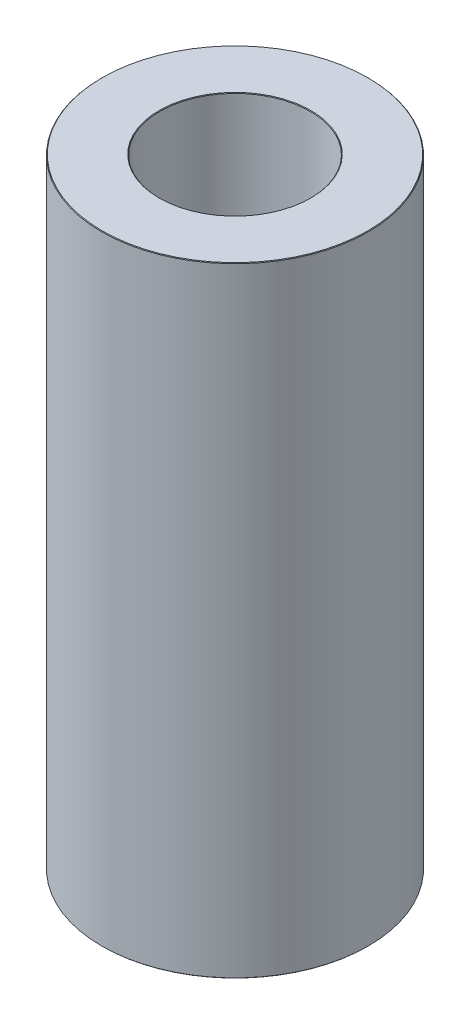
ISO-10303-21;
HEADER;
FILE_DESCRIPTION(('STEP AP214'),'2;1');
FILE_NAME('part.step','',(''),(''),'','','');
FILE_SCHEMA(('AUTOMOTIVE_DESIGN { 1 0 10303 214 1 1 1 1 }'));
ENDSEC;
DATA;
#1=APPLICATION_CONTEXT('core data for automotive mechanical design processes');
#2=APPLICATION_PROTOCOL_DEFINITION('international standard','automotive_design',2000,#1);
#3=PRODUCT_CONTEXT('',#1,'mechanical');
#4=PRODUCT('Part','Part','',(#3));
#5=PRODUCT_RELATED_PRODUCT_CATEGORY('part','',(#4));
#6=PRODUCT_DEFINITION_FORMATION('','',#4);
#7=PRODUCT_DEFINITION_CONTEXT('part definition',#1,'design');
#8=PRODUCT_DEFINITION('design','',#6,#7);
#9=PRODUCT_DEFINITION_SHAPE('','',#8);
#10=(LENGTH_UNIT() NAMED_UNIT(*) SI_UNIT(.MILLI.,.METRE.));
#11=(NAMED_UNIT(*) PLANE_ANGLE_UNIT() SI_UNIT($,.RADIAN.));
#12=(NAMED_UNIT(*) SI_UNIT($,.STERADIAN.) SOLID_ANGLE_UNIT());
#13=UNCERTAINTY_MEASURE_WITH_UNIT(LENGTH_MEASURE(1.E-05),#10,'distance_accuracy_value','');
#14=(GEOMETRIC_REPRESENTATION_CONTEXT(3) GLOBAL_UNCERTAINTY_ASSIGNED_CONTEXT((#13)) GLOBAL_UNIT_ASSIGNED_CONTEXT((#10,
#11,#12)) REPRESENTATION_CONTEXT('',''));
#15=CARTESIAN_POINT('',(0.,0.,0.));
#16=DIRECTION('',(0.,0.,1.));
#17=DIRECTION('',(1.,0.,0.));
#18=AXIS2_PLACEMENT_3D('',#15,#16,#17);
#19=CARTESIAN_POINT('',(0.,255.670603571409,0.));
#20=DIRECTION('',(0.,-1.,0.));
#21=DIRECTION('',(0.,0.,-1.));
#22=AXIS2_PLACEMENT_3D('',#19,#20,#21);
#23=CYLINDRICAL_SURFACE('',#22,55.);
#24=CARTESIAN_POINT('',(0.,0.228263649973415,0.));
#25=DIRECTION('',(0.,1.,0.));
#26=DIRECTION('',(0.,0.,1.));
#27=AXIS2_PLACEMENT_3D('',#24,#25,#26);
#28=CIRCLE('',#27,55.);
#29=CARTESIAN_POINT('',(0.,0.228263649973415,55.));
#30=VERTEX_POINT('',#29);
#31=EDGE_CURVE('E10',#30,#30,#28,.T.);
#32=ORIENTED_EDGE('',*,*,#31,.T.);
#33=EDGE_LOOP('',(#32));
#34=FACE_BOUND('',#33,.T.);
#35=CARTESIAN_POINT('',(0.,255.442339921435,0.));
#36=DIRECTION('',(0.,1.,0.));
#37=DIRECTION('',(0.,0.,1.));
#38=AXIS2_PLACEMENT_3D('',#35,#36,#37);
#39=CIRCLE('',#38,55.);
#40=CARTESIAN_POINT('',(0.,255.442339921435,-55.));
#41=VERTEX_POINT('',#40);
#42=EDGE_CURVE('E50',#41,#41,#39,.F.);
#43=ORIENTED_EDGE('',*,*,#42,.T.);
#44=EDGE_LOOP('',(#43));
#45=FACE_BOUND('',#44,.T.);
#46=ADVANCED_FACE('F39',(#34,#45),#23,.T.);
#47=CARTESIAN_POINT('',(0.,255.670603571409,0.));
#48=DIRECTION('',(0.,1.,0.));
#49=DIRECTION('',(0.,0.,1.));
#50=AXIS2_PLACEMENT_3D('',#47,#48,#49);
#51=PLANE('',#50);
#52=CARTESIAN_POINT('',(0.,255.670603571409,0.));
#53=DIRECTION('',(0.,1.,0.));
#54=DIRECTION('',(0.,0.,1.));
#55=AXIS2_PLACEMENT_3D('',#52,#53,#54);
#56=CIRCLE('',#55,31.3021153174133);
#57=CARTESIAN_POINT('',(0.,255.670603571409,31.3021153174133));
#58=VERTEX_POINT('',#57);
#59=EDGE_CURVE('E58',#58,#58,#56,.F.);
#60=ORIENTED_EDGE('',*,*,#59,.T.);
#61=EDGE_LOOP('',(#60));
#62=FACE_BOUND('',#61,.T.);
#63=CARTESIAN_POINT('',(0.,255.670603571409,0.));
#64=DIRECTION('',(0.,1.,0.));
#65=DIRECTION('',(0.,0.,1.));
#66=AXIS2_PLACEMENT_3D('',#63,#64,#65);
#67=CIRCLE('',#66,54.7717363500266);
#68=CARTESIAN_POINT('',(0.,255.670603571409,-54.7717363500266));
#69=VERTEX_POINT('',#68);
#70=EDGE_CURVE('E61',#69,#69,#67,.T.);
#71=ORIENTED_EDGE('',*,*,#70,.T.);
#72=EDGE_LOOP('',(#71));
#73=FACE_BOUND('',#72,.T.);
#74=ADVANCED_FACE('F88',(#62,#73),#51,.T.);
#75=CARTESIAN_POINT('',(0.,0.,0.));
#76=DIRECTION('',(0.,1.,0.));
#77=DIRECTION('',(0.,0.,1.));
#78=AXIS2_PLACEMENT_3D('',#75,#76,#77);
#79=PLANE('',#78);
#80=CARTESIAN_POINT('',(0.,0.,0.));
#81=DIRECTION('',(0.,1.,0.));
#82=DIRECTION('',(0.,0.,1.));
#83=AXIS2_PLACEMENT_3D('',#80,#81,#82);
#84=CIRCLE('',#83,31.3021153174134);
#85=CARTESIAN_POINT('',(0.,0.,31.3021153174134));
#86=VERTEX_POINT('',#85);
#87=EDGE_CURVE('E51',#86,#86,#84,.T.);
#88=ORIENTED_EDGE('',*,*,#87,.T.);
#89=EDGE_LOOP('',(#88));
#90=FACE_BOUND('',#89,.T.);
#91=CARTESIAN_POINT('',(0.,0.,0.));
#92=DIRECTION('',(0.,1.,0.));
#93=DIRECTION('',(0.,0.,1.));
#94=AXIS2_PLACEMENT_3D('',#91,#92,#93);
#95=CIRCLE('',#94,54.7717363500266);
#96=CARTESIAN_POINT('',(0.,0.,54.7717363500266));
#97=VERTEX_POINT('',#96);
#98=EDGE_CURVE('E54',#97,#97,#95,.F.);
#99=ORIENTED_EDGE('',*,*,#98,.T.);
#100=EDGE_LOOP('',(#99));
#101=FACE_BOUND('',#100,.T.);
#102=ADVANCED_FACE('F83',(#90,#101),#79,.F.);
#103=CARTESIAN_POINT('',(0.,255.670603571409,0.));
#104=DIRECTION('',(0.,-1.,0.));
#105=DIRECTION('',(0.,0.,-1.));
#106=AXIS2_PLACEMENT_3D('',#103,#104,#105);
#107=CYLINDRICAL_SURFACE('',#106,31.07385166744);
#108=CARTESIAN_POINT('',(0.,255.442339921435,0.));
#109=DIRECTION('',(0.,1.,0.));
#110=DIRECTION('',(0.,0.,1.));
#111=AXIS2_PLACEMENT_3D('',#108,#109,#110);
#112=CIRCLE('',#111,31.07385166744);
#113=CARTESIAN_POINT('',(0.,255.442339921435,31.07385166744));
#114=VERTEX_POINT('',#113);
#115=EDGE_CURVE('E67',#114,#114,#112,.T.);
#116=ORIENTED_EDGE('',*,*,#115,.T.);
#117=EDGE_LOOP('',(#116));
#118=FACE_BOUND('',#117,.T.);
#119=CARTESIAN_POINT('',(0.,0.228263649973415,0.));
#120=DIRECTION('',(0.,1.,0.));
#121=DIRECTION('',(0.,0.,1.));
#122=AXIS2_PLACEMENT_3D('',#119,#120,#121);
#123=CIRCLE('',#122,31.07385166744);
#124=CARTESIAN_POINT('',(0.,0.228263649973415,31.07385166744));
#125=VERTEX_POINT('',#124);
#126=EDGE_CURVE('E69',#125,#125,#123,.F.);
#127=ORIENTED_EDGE('',*,*,#126,.T.);
#128=EDGE_LOOP('',(#127));
#129=FACE_BOUND('',#128,.T.);
#130=ADVANCED_FACE('F71',(#118,#129),#107,.F.);
#131=CARTESIAN_POINT('',(0.,255.442339921435,0.));
#132=DIRECTION('',(0.,1.,0.));
#133=DIRECTION('',(0.,0.,1.));
#134=AXIS2_PLACEMENT_3D('',#131,#132,#133);
#135=CONICAL_SURFACE('',#134,31.07385166744,0.785398163397433);
#136=CARTESIAN_POINT('',(0.,255.670603571409,31.3021153174133));
#137=CARTESIAN_POINT('',(0.,255.668225825055,31.2997375710594));
#138=CARTESIAN_POINT('',(0.,255.665848078701,31.2973598247055));
#139=CARTESIAN_POINT('',(0.,255.661092585993,31.2926043319978));
#140=CARTESIAN_POINT('',(0.,255.658714839639,31.2902265856439));
#141=CARTESIAN_POINT('',(0.,255.653959346932,31.2854710929361));
#142=CARTESIAN_POINT('',(0.,255.651581600578,31.2830933465822));
#143=CARTESIAN_POINT('',(0.,255.64682610787,31.2783378538744));
#144=CARTESIAN_POINT('',(0.,255.644448361516,31.2759601075205));
#145=CARTESIAN_POINT('',(0.,255.639692868808,31.2712046148128));
#146=CARTESIAN_POINT('',(0.,255.637315122454,31.2688268684589));
#147=CARTESIAN_POINT('',(0.,255.632559629747,31.2640713757511));
#148=CARTESIAN_POINT('',(0.,255.630181883393,31.2616936293972));
#149=CARTESIAN_POINT('',(0.,255.625426390685,31.2569381366894));
#150=CARTESIAN_POINT('',(0.,255.623048644331,31.2545603903355));
#151=CARTESIAN_POINT('',(0.,255.618293151623,31.2498048976277));
#152=CARTESIAN_POINT('',(0.,255.615915405269,31.2474271512739));
#153=CARTESIAN_POINT('',(0.,255.611159912562,31.2426716585661));
#154=CARTESIAN_POINT('',(0.,255.608782166208,31.2402939122122));
#155=CARTESIAN_POINT('',(0.,255.6040266735,31.2355384195044));
#156=CARTESIAN_POINT('',(0.,255.601648927146,31.2331606731505));
#157=CARTESIAN_POINT('',(0.,255.596893434438,31.2284051804427));
#158=CARTESIAN_POINT('',(0.,255.594515688084,31.2260274340889));
#159=CARTESIAN_POINT('',(0.,255.589760195377,31.2212719413811));
#160=CARTESIAN_POINT('',(0.,255.587382449023,31.2188941950272));
#161=CARTESIAN_POINT('',(0.,255.582626956315,31.2141387023194));
#162=CARTESIAN_POINT('',(0.,255.580249209961,31.2117609559655));
#163=CARTESIAN_POINT('',(0.,255.575493717253,31.2070054632577));
#164=CARTESIAN_POINT('',(0.,255.573115970899,31.2046277169039));
#165=CARTESIAN_POINT('',(0.,255.568360478192,31.1998722241961));
#166=CARTESIAN_POINT('',(0.,255.565982731838,31.1974944778422));
#167=CARTESIAN_POINT('',(0.,255.56122723913,31.1927389851344));
#168=CARTESIAN_POINT('',(0.,255.558849492776,31.1903612387805));
#169=CARTESIAN_POINT('',(0.,255.554094000068,31.1856057460727));
#170=CARTESIAN_POINT('',(0.,255.551716253714,31.1832279997188));
#171=CARTESIAN_POINT('',(0.,255.546960761007,31.1784725070111));
#172=CARTESIAN_POINT('',(0.,255.544583014653,31.1760947606572));
#173=CARTESIAN_POINT('',(0.,255.539827521945,31.1713392679494));
#174=CARTESIAN_POINT('',(0.,255.537449775591,31.1689615215955));
#175=CARTESIAN_POINT('',(0.,255.532694282883,31.1642060288877));
#176=CARTESIAN_POINT('',(0.,255.530316536529,31.1618282825339));
#177=CARTESIAN_POINT('',(0.,255.525561043822,31.1570727898261));
#178=CARTESIAN_POINT('',(0.,255.523183297468,31.1546950434722));
#179=CARTESIAN_POINT('',(0.,255.51842780476,31.1499395507644));
#180=CARTESIAN_POINT('',(0.,255.516050058406,31.1475618044105));
#181=CARTESIAN_POINT('',(0.,255.511294565698,31.1428063117027));
#182=CARTESIAN_POINT('',(0.,255.508916819344,31.1404285653489));
#183=CARTESIAN_POINT('',(0.,255.504161326637,31.1356730726411));
#184=CARTESIAN_POINT('',(0.,255.501783580283,31.1332953262872));
#185=CARTESIAN_POINT('',(0.,255.497028087575,31.1285398335794));
#186=CARTESIAN_POINT('',(0.,255.494650341221,31.1261620872255));
#187=CARTESIAN_POINT('',(0.,255.489894848513,31.1214065945177));
#188=CARTESIAN_POINT('',(0.,255.487517102159,31.1190288481639));
#189=CARTESIAN_POINT('',(0.,255.482761609452,31.1142733554561));
#190=CARTESIAN_POINT('',(0.,255.480383863098,31.1118956091022));
#191=CARTESIAN_POINT('',(0.,255.47562837039,31.1071401163944));
#192=CARTESIAN_POINT('',(0.,255.473250624036,31.1047623700405));
#193=CARTESIAN_POINT('',(0.,255.468495131328,31.1000068773327));
#194=CARTESIAN_POINT('',(0.,255.466117384974,31.0976291309789));
#195=CARTESIAN_POINT('',(0.,255.461361892267,31.0928736382711));
#196=CARTESIAN_POINT('',(0.,255.458984145913,31.0904958919172));
#197=CARTESIAN_POINT('',(0.,255.454228653205,31.0857403992094));
#198=CARTESIAN_POINT('',(0.,255.451850906851,31.0833626528555));
#199=CARTESIAN_POINT('',(0.,255.447095414143,31.0786071601477));
#200=CARTESIAN_POINT('',(0.,255.444717667789,31.0762294137938));
#201=CARTESIAN_POINT('',(0.,255.442339921435,31.07385166744));
#202=B_SPLINE_CURVE_WITH_KNOTS('',3,(#136,#137,#138,#139,#140,#141,#142,#143,#144,#145,#146,
#147,#148,#149,#150,#151,#152,#153,#154,#155,#156,#157,#158,#159,#160,#161,#162,#163,#164,#165,
#166,#167,#168,#169,#170,#171,#172,#173,#174,#175,#176,#177,#178,#179,#180,#181,#182,#183,#184,
#185,#186,#187,#188,#189,#190,#191,#192,#193,#194,#195,#196,#197,#198,#199,#200,#201),
.UNSPECIFIED.,.F.,.F.,(4,2,2,2,2,2,2,2,2,2,2,2,2,2,2,2,2,2,2,2,2,2,2,2,2,2,2,2,2,2,2,2,4),(0.,
0.0100879234246474,0.0201758468492948,0.0302637702739471,0.0403516936986338,0.0504396171232812,
0.0605275405479286,0.0706154639725809,0.0807033873972676,0.090791310821915,0.100879234246562,
0.110967157671252,0.121055081095899,0.131143004520549,0.141230927945196,0.151318851369885,
0.161406774794533,0.17149469821918,0.181582621643869,0.191670545068517,0.201758468493167,
0.211846391917814,0.221934315342503,0.23202223876715,0.242110162191798,0.252198085616487,
0.262286009041134,0.272373932465784,0.282461855890432,0.292549779315121,0.302637702739768,
0.312725626164418,0.322813549589065),.UNSPECIFIED.);
#203=EDGE_CURVE('BSEAM77',#58,#114,#202,.T.);
#204=ORIENTED_EDGE('',*,*,#59,.F.);
#205=ORIENTED_EDGE('',*,*,#115,.F.);
#206=ORIENTED_EDGE('',*,*,#203,.T.);
#207=ORIENTED_EDGE('',*,*,#203,.F.);
#208=EDGE_LOOP('',(#204,#206,#205,#207));
#209=FACE_BOUND('',#208,.T.);
#210=ADVANCED_FACE('F77',(#209),#135,.F.);
#211=CARTESIAN_POINT('',(0.,0.,0.));
#212=DIRECTION('',(0.,-1.,0.));
#213=DIRECTION('',(0.,0.,-1.));
#214=AXIS2_PLACEMENT_3D('',#211,#212,#213);
#215=CONICAL_SURFACE('',#214,31.3021153174134,0.785398163397494);
#216=ORIENTED_EDGE('',*,*,#126,.F.);
#217=EDGE_LOOP('',(#216));
#218=FACE_BOUND('',#217,.T.);
#219=ORIENTED_EDGE('',*,*,#87,.F.);
#220=EDGE_LOOP('',(#219));
#221=FACE_BOUND('',#220,.T.);
#222=ADVANCED_FACE('F73',(#218,#221),#215,.F.);
#223=CARTESIAN_POINT('',(0.,0.228263649973415,0.));
#224=DIRECTION('',(0.,1.,0.));
#225=DIRECTION('',(0.,0.,1.));
#226=AXIS2_PLACEMENT_3D('',#223,#224,#225);
#227=CONICAL_SURFACE('',#226,55.,0.785398163397403);
#228=ORIENTED_EDGE('',*,*,#98,.F.);
#229=EDGE_LOOP('',(#228));
#230=FACE_BOUND('',#229,.T.);
#231=ORIENTED_EDGE('',*,*,#31,.F.);
#232=EDGE_LOOP('',(#231));
#233=FACE_BOUND('',#232,.T.);
#234=ADVANCED_FACE('F76',(#230,#233),#227,.T.);
#235=CARTESIAN_POINT('',(0.,255.670603571409,0.));
#236=DIRECTION('',(0.,-1.,0.));
#237=DIRECTION('',(0.,0.,-1.));
#238=AXIS2_PLACEMENT_3D('',#235,#236,#237);
#239=CONICAL_SURFACE('',#238,54.7717363500266,0.78539816339754);
#240=CARTESIAN_POINT('',(0.,255.442339921435,-55.));
#241=CARTESIAN_POINT('',(0.,255.444717667789,-54.9976222536461));
#242=CARTESIAN_POINT('',(0.,255.447095414143,-54.9952445072922));
#243=CARTESIAN_POINT('',(0.,255.451850906851,-54.9904890145845));
#244=CARTESIAN_POINT('',(0.,255.454228653205,-54.9881112682306));
#245=CARTESIAN_POINT('',(0.,255.458984145913,-54.9833557755228));
#246=CARTESIAN_POINT('',(0.,255.461361892267,-54.9809780291689));
#247=CARTESIAN_POINT('',(0.,255.466117384974,-54.9762225364611));
#248=CARTESIAN_POINT('',(0.,255.468495131328,-54.9738447901072));
#249=CARTESIAN_POINT('',(0.,255.473250624036,-54.9690892973995));
#250=CARTESIAN_POINT('',(0.,255.47562837039,-54.9667115510456));
#251=CARTESIAN_POINT('',(0.,255.480383863098,-54.9619560583378));
#252=CARTESIAN_POINT('',(0.,255.482761609452,-54.9595783119839));
#253=CARTESIAN_POINT('',(0.,255.487517102159,-54.9548228192761));
#254=CARTESIAN_POINT('',(0.,255.489894848513,-54.9524450729222));
#255=CARTESIAN_POINT('',(0.,255.494650341221,-54.9476895802145));
#256=CARTESIAN_POINT('',(0.,255.497028087575,-54.9453118338606));
#257=CARTESIAN_POINT('',(0.,255.501783580283,-54.9405563411528));
#258=CARTESIAN_POINT('',(0.,255.504161326637,-54.9381785947989));
#259=CARTESIAN_POINT('',(0.,255.508916819344,-54.9334231020911));
#260=CARTESIAN_POINT('',(0.,255.511294565698,-54.9310453557372));
#261=CARTESIAN_POINT('',(0.,255.516050058406,-54.9262898630295));
#262=CARTESIAN_POINT('',(0.,255.51842780476,-54.9239121166756));
#263=CARTESIAN_POINT('',(0.,255.523183297468,-54.9191566239678));
#264=CARTESIAN_POINT('',(0.,255.525561043822,-54.9167788776139));
#265=CARTESIAN_POINT('',(0.,255.530316536529,-54.9120233849061));
#266=CARTESIAN_POINT('',(0.,255.532694282883,-54.9096456385522));
#267=CARTESIAN_POINT('',(0.,255.537449775591,-54.9048901458444));
#268=CARTESIAN_POINT('',(0.,255.539827521945,-54.9025123994906));
#269=CARTESIAN_POINT('',(0.,255.544583014653,-54.8977569067828));
#270=CARTESIAN_POINT('',(0.,255.546960761007,-54.8953791604289));
#271=CARTESIAN_POINT('',(0.,255.551716253714,-54.8906236677211));
#272=CARTESIAN_POINT('',(0.,255.554094000068,-54.8882459213672));
#273=CARTESIAN_POINT('',(0.,255.558849492776,-54.8834904286594));
#274=CARTESIAN_POINT('',(0.,255.56122723913,-54.8811126823055));
#275=CARTESIAN_POINT('',(0.,255.565982731838,-54.8763571895978));
#276=CARTESIAN_POINT('',(0.,255.568360478192,-54.8739794432439));
#277=CARTESIAN_POINT('',(0.,255.573115970899,-54.8692239505361));
#278=CARTESIAN_POINT('',(0.,255.575493717253,-54.8668462041822));
#279=CARTESIAN_POINT('',(0.,255.580249209961,-54.8620907114744));
#280=CARTESIAN_POINT('',(0.,255.582626956315,-54.8597129651205));
#281=CARTESIAN_POINT('',(0.,255.587382449023,-54.8549574724128));
#282=CARTESIAN_POINT('',(0.,255.589760195377,-54.8525797260589));
#283=CARTESIAN_POINT('',(0.,255.594515688084,-54.8478242333511));
#284=CARTESIAN_POINT('',(0.,255.596893434438,-54.8454464869972));
#285=CARTESIAN_POINT('',(0.,255.601648927146,-54.8406909942894));
#286=CARTESIAN_POINT('',(0.,255.6040266735,-54.8383132479355));
#287=CARTESIAN_POINT('',(0.,255.608782166208,-54.8335577552278));
#288=CARTESIAN_POINT('',(0.,255.611159912562,-54.8311800088739));
#289=CARTESIAN_POINT('',(0.,255.615915405269,-54.8264245161661));
#290=CARTESIAN_POINT('',(0.,255.618293151623,-54.8240467698122));
#291=CARTESIAN_POINT('',(0.,255.623048644331,-54.8192912771044));
#292=CARTESIAN_POINT('',(0.,255.625426390685,-54.8169135307505));
#293=CARTESIAN_POINT('',(0.,255.630181883393,-54.8121580380427));
#294=CARTESIAN_POINT('',(0.,255.632559629747,-54.8097802916889));
#295=CARTESIAN_POINT('',(0.,255.637315122454,-54.8050247989811));
#296=CARTESIAN_POINT('',(0.,255.639692868808,-54.8026470526272));
#297=CARTESIAN_POINT('',(0.,255.644448361516,-54.7978915599194));
#298=CARTESIAN_POINT('',(0.,255.64682610787,-54.7955138135655));
#299=CARTESIAN_POINT('',(0.,255.651581600578,-54.7907583208577));
#300=CARTESIAN_POINT('',(0.,255.653959346932,-54.7883805745039));
#301=CARTESIAN_POINT('',(0.,255.658714839639,-54.7836250817961));
#302=CARTESIAN_POINT('',(0.,255.661092585993,-54.7812473354422));
#303=CARTESIAN_POINT('',(0.,255.665848078701,-54.7764918427344));
#304=CARTESIAN_POINT('',(0.,255.668225825055,-54.7741140963805));
#305=CARTESIAN_POINT('',(0.,255.670603571409,-54.7717363500266));
#306=B_SPLINE_CURVE_WITH_KNOTS('',3,(#240,#241,#242,#243,#244,#245,#246,#247,#248,#249,#250,
#251,#252,#253,#254,#255,#256,#257,#258,#259,#260,#261,#262,#263,#264,#265,#266,#267,#268,#269,
#270,#271,#272,#273,#274,#275,#276,#277,#278,#279,#280,#281,#282,#283,#284,#285,#286,#287,#288,
#289,#290,#291,#292,#293,#294,#295,#296,#297,#298,#299,#300,#301,#302,#303,#304,#305),
.UNSPECIFIED.,.F.,.F.,(4,2,2,2,2,2,2,2,2,2,2,2,2,2,2,2,2,2,2,2,2,2,2,2,2,2,2,2,2,2,2,2,4),(0.,
0.0100879234246474,0.0201758468492997,0.0302637702739471,0.0403516936986387,0.0504396171232861,
0.0605275405479384,0.0706154639725858,0.0807033873972725,0.0907913108219248,0.100879234246572,
0.110967157671264,0.121055081095911,0.131143004520564,0.141230927945211,0.151318851369903,
0.16140677479455,0.171494698219197,0.181582621643889,0.191670545068536,0.201758468493189,
0.211846391917836,0.221934315342528,0.232022238767175,0.242110162191822,0.252198085616514,
0.262286009041161,0.272373932465814,0.282461855890461,0.292549779315153,0.3026377027398,
0.312725626164452,0.322813549589139),.UNSPECIFIED.);
#307=EDGE_CURVE('BSEAM45',#41,#69,#306,.T.);
#308=ORIENTED_EDGE('',*,*,#42,.F.);
#309=ORIENTED_EDGE('',*,*,#70,.F.);
#310=ORIENTED_EDGE('',*,*,#307,.T.);
#311=ORIENTED_EDGE('',*,*,#307,.F.);
#312=EDGE_LOOP('',(#308,#310,#309,#311));
#313=FACE_BOUND('',#312,.T.);
#314=ADVANCED_FACE('F45',(#313),#239,.T.);
#315=CLOSED_SHELL('',(#46,#74,#102,#130,#210,#222,#234,#314));
#316=MANIFOLD_SOLID_BREP('B2',#315);
#317=ADVANCED_BREP_SHAPE_REPRESENTATION('',(#18,#316),#14);
#318=SHAPE_DEFINITION_REPRESENTATION(#9,#317);
ENDSEC;
END-ISO-10303-21;
